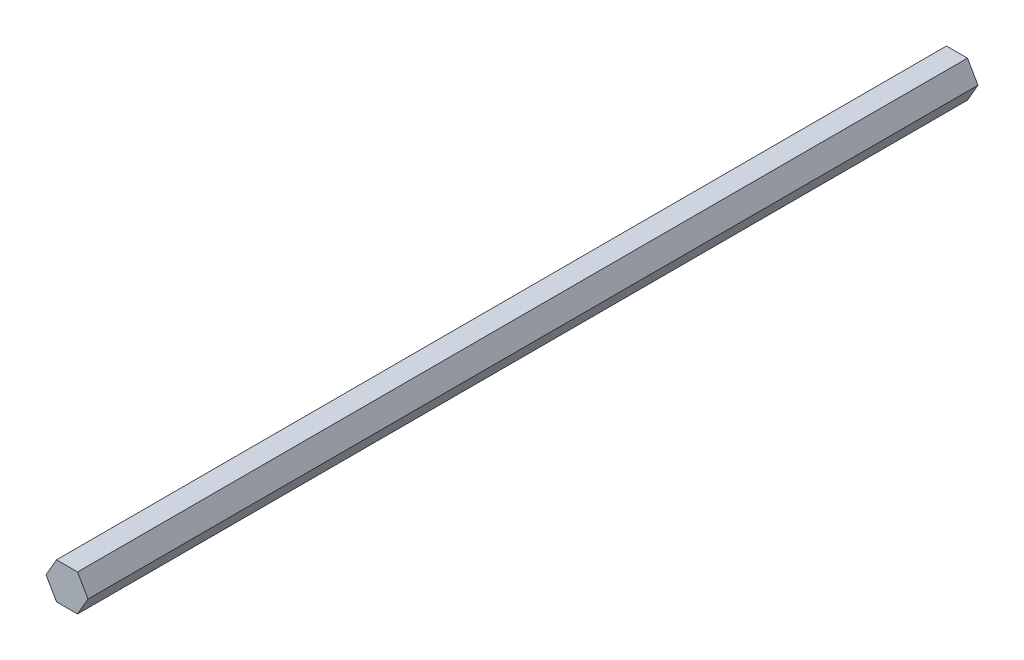
ISO-10303-21;
HEADER;
FILE_DESCRIPTION(('STEP AP214'),'2;1');
FILE_NAME('part.step','',(''),(''),'','','');
FILE_SCHEMA(('AUTOMOTIVE_DESIGN { 1 0 10303 214 1 1 1 1 }'));
ENDSEC;
DATA;
#1=APPLICATION_CONTEXT('core data for automotive mechanical design processes');
#2=APPLICATION_PROTOCOL_DEFINITION('international standard','automotive_design',2000,#1);
#3=PRODUCT_CONTEXT('',#1,'mechanical');
#4=PRODUCT('Part','Part','',(#3));
#5=PRODUCT_RELATED_PRODUCT_CATEGORY('part','',(#4));
#6=PRODUCT_DEFINITION_FORMATION('','',#4);
#7=PRODUCT_DEFINITION_CONTEXT('part definition',#1,'design');
#8=PRODUCT_DEFINITION('design','',#6,#7);
#9=PRODUCT_DEFINITION_SHAPE('','',#8);
#10=(LENGTH_UNIT() NAMED_UNIT(*) SI_UNIT(.MILLI.,.METRE.));
#11=(NAMED_UNIT(*) PLANE_ANGLE_UNIT() SI_UNIT($,.RADIAN.));
#12=(NAMED_UNIT(*) SI_UNIT($,.STERADIAN.) SOLID_ANGLE_UNIT());
#13=UNCERTAINTY_MEASURE_WITH_UNIT(LENGTH_MEASURE(1.E-05),#10,'distance_accuracy_value','');
#14=(GEOMETRIC_REPRESENTATION_CONTEXT(3) GLOBAL_UNCERTAINTY_ASSIGNED_CONTEXT((#13)) GLOBAL_UNIT_ASSIGNED_CONTEXT((#10,
#11,#12)) REPRESENTATION_CONTEXT('',''));
#15=CARTESIAN_POINT('',(0.,0.,0.));
#16=DIRECTION('',(0.,0.,1.));
#17=DIRECTION('',(1.,0.,0.));
#18=AXIS2_PLACEMENT_3D('',#15,#16,#17);
#19=CARTESIAN_POINT('',(3.66617420935419,-6.34999999999995,310.4));
#20=DIRECTION('',(-0.866025403784441,0.499999999999995,0.));
#21=DIRECTION('',(-0.499999999999995,-0.866025403784441,0.));
#22=AXIS2_PLACEMENT_3D('',#19,#20,#21);
#23=PLANE('',#22);
#24=DIRECTION('',(0.499999999999995,0.866025403784441,0.));
#25=VECTOR('',#24,1.);
#26=CARTESIAN_POINT('',(3.66617420935419,-6.34999999999995,0.));
#27=LINE('',#26,#25);
#28=CARTESIAN_POINT('',(3.66617420935419,-6.34999999999995,0.));
#29=VERTEX_POINT('',#28);
#30=CARTESIAN_POINT('',(7.33234841870824,0.,0.));
#31=VERTEX_POINT('',#30);
#32=EDGE_CURVE('E121',#29,#31,#27,.T.);
#33=ORIENTED_EDGE('',*,*,#32,.T.);
#34=DIRECTION('',(0.,0.,-1.));
#35=VECTOR('',#34,1.);
#36=CARTESIAN_POINT('',(7.33234841870824,0.,310.4));
#37=LINE('',#36,#35);
#38=CARTESIAN_POINT('',(7.33234841870824,0.,310.4));
#39=VERTEX_POINT('',#38);
#40=EDGE_CURVE('E11',#39,#31,#37,.T.);
#41=ORIENTED_EDGE('',*,*,#40,.F.);
#42=DIRECTION('',(0.499999999999995,0.866025403784441,0.));
#43=VECTOR('',#42,1.);
#44=CARTESIAN_POINT('',(3.66617420935419,-6.34999999999995,310.4));
#45=LINE('',#44,#43);
#46=CARTESIAN_POINT('',(3.66617420935419,-6.34999999999995,310.4));
#47=VERTEX_POINT('',#46);
#48=EDGE_CURVE('E133',#47,#39,#45,.T.);
#49=ORIENTED_EDGE('',*,*,#48,.F.);
#50=DIRECTION('',(0.,0.,-1.));
#51=VECTOR('',#50,1.);
#52=CARTESIAN_POINT('',(3.66617420935419,-6.34999999999995,310.4));
#53=LINE('',#52,#51);
#54=EDGE_CURVE('E119',#47,#29,#53,.T.);
#55=ORIENTED_EDGE('',*,*,#54,.T.);
#56=EDGE_LOOP('',(#33,#41,#49,#55));
#57=FACE_BOUND('',#56,.T.);
#58=ADVANCED_FACE('F39',(#57),#23,.F.);
#59=CARTESIAN_POINT('',(7.33234841870824,0.,310.4));
#60=DIRECTION('',(-0.866025403784438,-0.500000000000001,0.));
#61=DIRECTION('',(0.500000000000001,-0.866025403784438,0.));
#62=AXIS2_PLACEMENT_3D('',#59,#60,#61);
#63=PLANE('',#62);
#64=DIRECTION('',(-0.500000000000001,0.866025403784438,0.));
#65=VECTOR('',#64,1.);
#66=CARTESIAN_POINT('',(7.33234841870824,0.,0.));
#67=LINE('',#66,#65);
#68=CARTESIAN_POINT('',(3.6661742093541,6.35,0.));
#69=VERTEX_POINT('',#68);
#70=EDGE_CURVE('E128',#31,#69,#67,.T.);
#71=ORIENTED_EDGE('',*,*,#70,.T.);
#72=DIRECTION('',(0.,0.,-1.));
#73=VECTOR('',#72,1.);
#74=CARTESIAN_POINT('',(3.6661742093541,6.35,310.4));
#75=LINE('',#74,#73);
#76=CARTESIAN_POINT('',(3.6661742093541,6.35,310.4));
#77=VERTEX_POINT('',#76);
#78=EDGE_CURVE('E50',#77,#69,#75,.T.);
#79=ORIENTED_EDGE('',*,*,#78,.F.);
#80=DIRECTION('',(-0.500000000000001,0.866025403784438,0.));
#81=VECTOR('',#80,1.);
#82=CARTESIAN_POINT('',(7.33234841870824,0.,310.4));
#83=LINE('',#82,#81);
#84=EDGE_CURVE('E95',#39,#77,#83,.T.);
#85=ORIENTED_EDGE('',*,*,#84,.F.);
#86=ORIENTED_EDGE('',*,*,#40,.T.);
#87=EDGE_LOOP('',(#71,#79,#85,#86));
#88=FACE_BOUND('',#87,.T.);
#89=ADVANCED_FACE('F160',(#88),#63,.F.);
#90=CARTESIAN_POINT('',(3.6661742093541,6.35,310.4));
#91=DIRECTION('',(0.,-1.,0.));
#92=DIRECTION('',(1.,0.,0.));
#93=AXIS2_PLACEMENT_3D('',#90,#91,#92);
#94=PLANE('',#93);
#95=DIRECTION('',(-1.,0.,0.));
#96=VECTOR('',#95,1.);
#97=CARTESIAN_POINT('',(3.6661742093541,6.35,0.));
#98=LINE('',#97,#96);
#99=CARTESIAN_POINT('',(-3.66617420935415,6.34999999999998,0.));
#100=VERTEX_POINT('',#99);
#101=EDGE_CURVE('E126',#69,#100,#98,.T.);
#102=ORIENTED_EDGE('',*,*,#101,.T.);
#103=DIRECTION('',(0.,0.,-1.));
#104=VECTOR('',#103,1.);
#105=CARTESIAN_POINT('',(-3.66617420935415,6.34999999999998,310.4));
#106=LINE('',#105,#104);
#107=CARTESIAN_POINT('',(-3.66617420935415,6.34999999999998,310.4));
#108=VERTEX_POINT('',#107);
#109=EDGE_CURVE('E114',#108,#100,#106,.T.);
#110=ORIENTED_EDGE('',*,*,#109,.F.);
#111=DIRECTION('',(-1.,0.,0.));
#112=VECTOR('',#111,1.);
#113=CARTESIAN_POINT('',(3.6661742093541,6.35,310.4));
#114=LINE('',#113,#112);
#115=EDGE_CURVE('E103',#77,#108,#114,.T.);
#116=ORIENTED_EDGE('',*,*,#115,.F.);
#117=ORIENTED_EDGE('',*,*,#78,.T.);
#118=EDGE_LOOP('',(#102,#110,#116,#117));
#119=FACE_BOUND('',#118,.T.);
#120=ADVANCED_FACE('F137',(#119),#94,.F.);
#121=CARTESIAN_POINT('',(-3.66617420935415,6.34999999999998,310.4));
#122=DIRECTION('',(0.866025403784442,-0.499999999999995,0.));
#123=DIRECTION('',(0.499999999999995,0.866025403784442,0.));
#124=AXIS2_PLACEMENT_3D('',#121,#122,#123);
#125=PLANE('',#124);
#126=DIRECTION('',(-0.499999999999995,-0.866025403784441,0.));
#127=VECTOR('',#126,1.);
#128=CARTESIAN_POINT('',(-3.66617420935415,6.34999999999998,0.));
#129=LINE('',#128,#127);
#130=CARTESIAN_POINT('',(-7.33234841870824,0.,0.));
#131=VERTEX_POINT('',#130);
#132=EDGE_CURVE('E111',#100,#131,#129,.T.);
#133=ORIENTED_EDGE('',*,*,#132,.T.);
#134=DIRECTION('',(0.,0.,-1.));
#135=VECTOR('',#134,1.);
#136=CARTESIAN_POINT('',(-7.33234841870824,0.,310.4));
#137=LINE('',#136,#135);
#138=CARTESIAN_POINT('',(-7.33234841870824,0.,310.4));
#139=VERTEX_POINT('',#138);
#140=EDGE_CURVE('E106',#139,#131,#137,.T.);
#141=ORIENTED_EDGE('',*,*,#140,.F.);
#142=DIRECTION('',(-0.499999999999995,-0.866025403784441,0.));
#143=VECTOR('',#142,1.);
#144=CARTESIAN_POINT('',(-3.66617420935415,6.34999999999998,310.4));
#145=LINE('',#144,#143);
#146=EDGE_CURVE('E98',#108,#139,#145,.T.);
#147=ORIENTED_EDGE('',*,*,#146,.F.);
#148=ORIENTED_EDGE('',*,*,#109,.T.);
#149=EDGE_LOOP('',(#133,#141,#147,#148));
#150=FACE_BOUND('',#149,.T.);
#151=ADVANCED_FACE('F112',(#150),#125,.F.);
#152=CARTESIAN_POINT('',(-7.33234841870824,0.,310.4));
#153=DIRECTION('',(0.866025403784435,0.500000000000007,0.));
#154=DIRECTION('',(-0.500000000000007,0.866025403784434,0.));
#155=AXIS2_PLACEMENT_3D('',#152,#153,#154);
#156=PLANE('',#155);
#157=DIRECTION('',(0.500000000000007,-0.866025403784435,0.));
#158=VECTOR('',#157,1.);
#159=CARTESIAN_POINT('',(-7.33234841870824,0.,0.));
#160=LINE('',#159,#158);
#161=CARTESIAN_POINT('',(-3.66617420935406,-6.35000000000003,0.));
#162=VERTEX_POINT('',#161);
#163=EDGE_CURVE('E76',#131,#162,#160,.T.);
#164=ORIENTED_EDGE('',*,*,#163,.T.);
#165=DIRECTION('',(0.,0.,-1.));
#166=VECTOR('',#165,1.);
#167=CARTESIAN_POINT('',(-3.66617420935406,-6.35000000000003,310.4));
#168=LINE('',#167,#166);
#169=CARTESIAN_POINT('',(-3.66617420935406,-6.35000000000003,310.4));
#170=VERTEX_POINT('',#169);
#171=EDGE_CURVE('E113',#170,#162,#168,.T.);
#172=ORIENTED_EDGE('',*,*,#171,.F.);
#173=DIRECTION('',(0.500000000000007,-0.866025403784435,0.));
#174=VECTOR('',#173,1.);
#175=CARTESIAN_POINT('',(-7.33234841870824,0.,310.4));
#176=LINE('',#175,#174);
#177=EDGE_CURVE('E104',#139,#170,#176,.T.);
#178=ORIENTED_EDGE('',*,*,#177,.F.);
#179=ORIENTED_EDGE('',*,*,#140,.T.);
#180=EDGE_LOOP('',(#164,#172,#178,#179));
#181=FACE_BOUND('',#180,.T.);
#182=ADVANCED_FACE('F120',(#181),#156,.F.);
#183=CARTESIAN_POINT('',(-3.66617420935406,-6.35000000000003,310.4));
#184=DIRECTION('',(0.,1.,0.));
#185=DIRECTION('',(-1.,0.,0.));
#186=AXIS2_PLACEMENT_3D('',#183,#184,#185);
#187=PLANE('',#186);
#188=DIRECTION('',(1.,0.,0.));
#189=VECTOR('',#188,1.);
#190=CARTESIAN_POINT('',(-3.66617420935406,-6.35000000000003,0.));
#191=LINE('',#190,#189);
#192=EDGE_CURVE('E84',#162,#29,#191,.T.);
#193=ORIENTED_EDGE('',*,*,#192,.T.);
#194=ORIENTED_EDGE('',*,*,#54,.F.);
#195=DIRECTION('',(1.,0.,0.));
#196=VECTOR('',#195,1.);
#197=CARTESIAN_POINT('',(-3.66617420935406,-6.35000000000003,310.4));
#198=LINE('',#197,#196);
#199=EDGE_CURVE('E54',#170,#47,#198,.T.);
#200=ORIENTED_EDGE('',*,*,#199,.F.);
#201=ORIENTED_EDGE('',*,*,#171,.T.);
#202=EDGE_LOOP('',(#193,#194,#200,#201));
#203=FACE_BOUND('',#202,.T.);
#204=ADVANCED_FACE('F147',(#203),#187,.F.);
#205=CARTESIAN_POINT('',(0.,0.,310.4));
#206=DIRECTION('',(0.,0.,1.));
#207=DIRECTION('',(1.,0.,0.));
#208=AXIS2_PLACEMENT_3D('',#205,#206,#207);
#209=PLANE('',#208);
#210=ORIENTED_EDGE('',*,*,#48,.T.);
#211=ORIENTED_EDGE('',*,*,#84,.T.);
#212=ORIENTED_EDGE('',*,*,#115,.T.);
#213=ORIENTED_EDGE('',*,*,#146,.T.);
#214=ORIENTED_EDGE('',*,*,#177,.T.);
#215=ORIENTED_EDGE('',*,*,#199,.T.);
#216=EDGE_LOOP('',(#210,#211,#212,#213,#214,#215));
#217=FACE_BOUND('',#216,.T.);
#218=ADVANCED_FACE('F102',(#217),#209,.T.);
#219=CARTESIAN_POINT('',(0.,0.,0.));
#220=DIRECTION('',(0.,0.,1.));
#221=DIRECTION('',(1.,0.,0.));
#222=AXIS2_PLACEMENT_3D('',#219,#220,#221);
#223=PLANE('',#222);
#224=ORIENTED_EDGE('',*,*,#32,.F.);
#225=ORIENTED_EDGE('',*,*,#192,.F.);
#226=ORIENTED_EDGE('',*,*,#163,.F.);
#227=ORIENTED_EDGE('',*,*,#132,.F.);
#228=ORIENTED_EDGE('',*,*,#101,.F.);
#229=ORIENTED_EDGE('',*,*,#70,.F.);
#230=EDGE_LOOP('',(#224,#225,#226,#227,#228,#229));
#231=FACE_BOUND('',#230,.T.);
#232=ADVANCED_FACE('F145',(#231),#223,.F.);
#233=CLOSED_SHELL('',(#58,#89,#120,#151,#182,#204,#218,#232));
#234=MANIFOLD_SOLID_BREP('B2',#233);
#235=ADVANCED_BREP_SHAPE_REPRESENTATION('',(#18,#234),#14);
#236=SHAPE_DEFINITION_REPRESENTATION(#9,#235);
ENDSEC;
END-ISO-10303-21;
